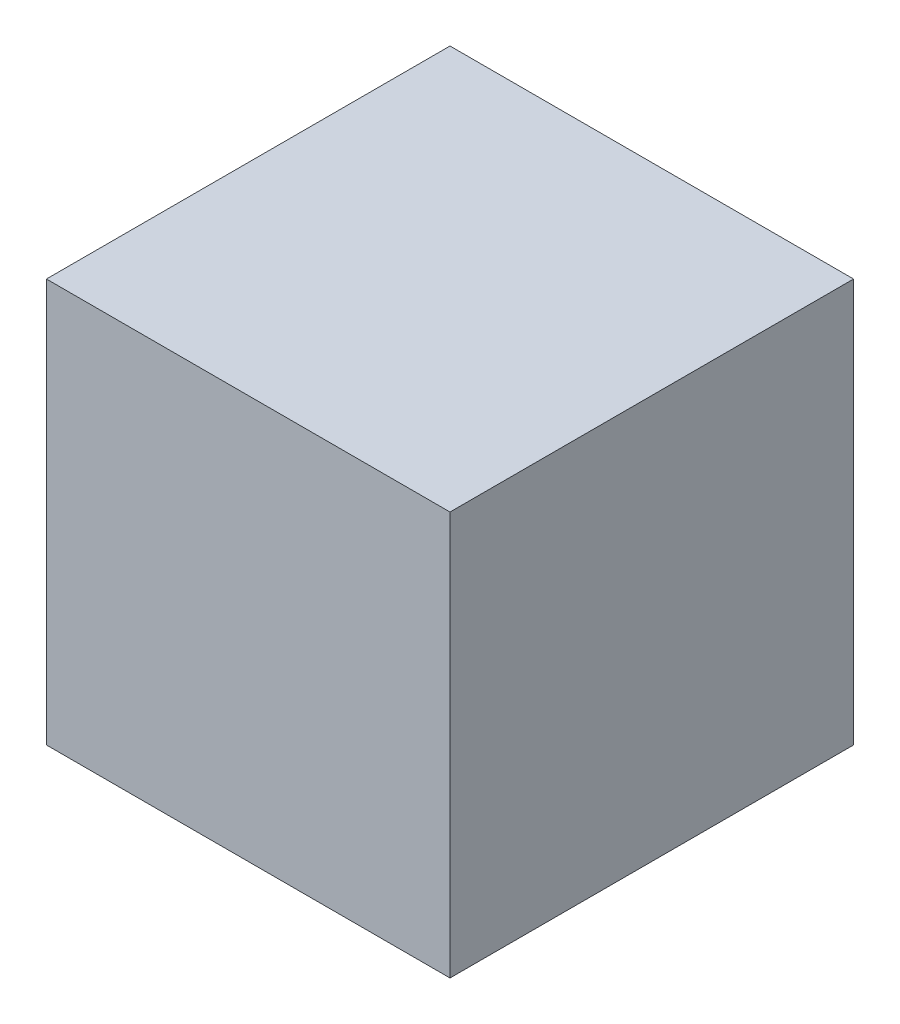
ISO-10303-21;
HEADER;
FILE_DESCRIPTION(('STEP AP214'),'2;1');
FILE_NAME('part.step','',(''),(''),'','','');
FILE_SCHEMA(('AUTOMOTIVE_DESIGN { 1 0 10303 214 1 1 1 1 }'));
ENDSEC;
DATA;
#1=APPLICATION_CONTEXT('core data for automotive mechanical design processes');
#2=APPLICATION_PROTOCOL_DEFINITION('international standard','automotive_design',2000,#1);
#3=PRODUCT_CONTEXT('',#1,'mechanical');
#4=PRODUCT('Part','Part','',(#3));
#5=PRODUCT_RELATED_PRODUCT_CATEGORY('part','',(#4));
#6=PRODUCT_DEFINITION_FORMATION('','',#4);
#7=PRODUCT_DEFINITION_CONTEXT('part definition',#1,'design');
#8=PRODUCT_DEFINITION('design','',#6,#7);
#9=PRODUCT_DEFINITION_SHAPE('','',#8);
#10=(LENGTH_UNIT() NAMED_UNIT(*) SI_UNIT(.MILLI.,.METRE.));
#11=(NAMED_UNIT(*) PLANE_ANGLE_UNIT() SI_UNIT($,.RADIAN.));
#12=(NAMED_UNIT(*) SI_UNIT($,.STERADIAN.) SOLID_ANGLE_UNIT());
#13=UNCERTAINTY_MEASURE_WITH_UNIT(LENGTH_MEASURE(1.E-05),#10,'distance_accuracy_value','');
#14=(GEOMETRIC_REPRESENTATION_CONTEXT(3) GLOBAL_UNCERTAINTY_ASSIGNED_CONTEXT((#13)) GLOBAL_UNIT_ASSIGNED_CONTEXT((#10,
#11,#12)) REPRESENTATION_CONTEXT('',''));
#15=CARTESIAN_POINT('',(0.,0.,0.));
#16=DIRECTION('',(0.,0.,1.));
#17=DIRECTION('',(1.,0.,0.));
#18=AXIS2_PLACEMENT_3D('',#15,#16,#17);
#19=CARTESIAN_POINT('',(311.4675,-311.4675,-311.4675));
#20=DIRECTION('',(0.,0.,1.));
#21=DIRECTION('',(1.,0.,0.));
#22=AXIS2_PLACEMENT_3D('',#19,#20,#21);
#23=PLANE('',#22);
#24=DIRECTION('',(0.,1.,0.));
#25=VECTOR('',#24,1.);
#26=CARTESIAN_POINT('',(-311.4675,-311.4675,-311.4675));
#27=LINE('',#26,#25);
#28=CARTESIAN_POINT('',(-311.4675,-311.4675,-311.4675));
#29=VERTEX_POINT('',#28);
#30=CARTESIAN_POINT('',(-311.4675,311.4675,-311.4675));
#31=VERTEX_POINT('',#30);
#32=EDGE_CURVE('E94',#29,#31,#27,.T.);
#33=ORIENTED_EDGE('',*,*,#32,.T.);
#34=DIRECTION('',(-1.,0.,0.));
#35=VECTOR('',#34,1.);
#36=CARTESIAN_POINT('',(311.4675,311.4675,-311.4675));
#37=LINE('',#36,#35);
#38=CARTESIAN_POINT('',(311.4675,311.4675,-311.4675));
#39=VERTEX_POINT('',#38);
#40=EDGE_CURVE('E11',#39,#31,#37,.T.);
#41=ORIENTED_EDGE('',*,*,#40,.F.);
#42=DIRECTION('',(0.,1.,0.));
#43=VECTOR('',#42,1.);
#44=CARTESIAN_POINT('',(311.4675,-311.4675,-311.4675));
#45=LINE('',#44,#43);
#46=CARTESIAN_POINT('',(311.4675,-311.4675,-311.4675));
#47=VERTEX_POINT('',#46);
#48=EDGE_CURVE('E82',#47,#39,#45,.T.);
#49=ORIENTED_EDGE('',*,*,#48,.F.);
#50=DIRECTION('',(-1.,0.,0.));
#51=VECTOR('',#50,1.);
#52=CARTESIAN_POINT('',(311.4675,-311.4675,-311.4675));
#53=LINE('',#52,#51);
#54=EDGE_CURVE('E90',#47,#29,#53,.T.);
#55=ORIENTED_EDGE('',*,*,#54,.T.);
#56=EDGE_LOOP('',(#33,#41,#49,#55));
#57=FACE_BOUND('',#56,.T.);
#58=ADVANCED_FACE('F31',(#57),#23,.F.);
#59=CARTESIAN_POINT('',(311.4675,311.4675,311.4675));
#60=DIRECTION('',(0.,-1.,0.));
#61=DIRECTION('',(0.,0.,-1.));
#62=AXIS2_PLACEMENT_3D('',#59,#60,#61);
#63=PLANE('',#62);
#64=DIRECTION('',(0.,0.,1.));
#65=VECTOR('',#64,1.);
#66=CARTESIAN_POINT('',(-311.4675,311.4675,311.4675));
#67=LINE('',#66,#65);
#68=CARTESIAN_POINT('',(-311.4675,311.4675,311.4675));
#69=VERTEX_POINT('',#68);
#70=EDGE_CURVE('E86',#31,#69,#67,.T.);
#71=ORIENTED_EDGE('',*,*,#70,.T.);
#72=DIRECTION('',(-1.,0.,0.));
#73=VECTOR('',#72,1.);
#74=CARTESIAN_POINT('',(311.4675,311.4675,311.4675));
#75=LINE('',#74,#73);
#76=CARTESIAN_POINT('',(311.4675,311.4675,311.4675));
#77=VERTEX_POINT('',#76);
#78=EDGE_CURVE('E39',#77,#69,#75,.T.);
#79=ORIENTED_EDGE('',*,*,#78,.F.);
#80=DIRECTION('',(0.,0.,1.));
#81=VECTOR('',#80,1.);
#82=CARTESIAN_POINT('',(311.4675,311.4675,311.4675));
#83=LINE('',#82,#81);
#84=EDGE_CURVE('E77',#39,#77,#83,.T.);
#85=ORIENTED_EDGE('',*,*,#84,.F.);
#86=ORIENTED_EDGE('',*,*,#40,.T.);
#87=EDGE_LOOP('',(#71,#79,#85,#86));
#88=FACE_BOUND('',#87,.T.);
#89=ADVANCED_FACE('F85',(#88),#63,.F.);
#90=CARTESIAN_POINT('',(311.4675,-311.4675,311.4675));
#91=DIRECTION('',(0.,0.,-1.));
#92=DIRECTION('',(-1.,0.,0.));
#93=AXIS2_PLACEMENT_3D('',#90,#91,#92);
#94=PLANE('',#93);
#95=DIRECTION('',(0.,-1.,0.));
#96=VECTOR('',#95,1.);
#97=CARTESIAN_POINT('',(-311.4675,-311.4675,311.4675));
#98=LINE('',#97,#96);
#99=CARTESIAN_POINT('',(-311.4675,-311.4675,311.4675));
#100=VERTEX_POINT('',#99);
#101=EDGE_CURVE('E64',#69,#100,#98,.T.);
#102=ORIENTED_EDGE('',*,*,#101,.T.);
#103=DIRECTION('',(-1.,0.,0.));
#104=VECTOR('',#103,1.);
#105=CARTESIAN_POINT('',(311.4675,-311.4675,311.4675));
#106=LINE('',#105,#104);
#107=CARTESIAN_POINT('',(311.4675,-311.4675,311.4675));
#108=VERTEX_POINT('',#107);
#109=EDGE_CURVE('E87',#108,#100,#106,.T.);
#110=ORIENTED_EDGE('',*,*,#109,.F.);
#111=DIRECTION('',(0.,-1.,0.));
#112=VECTOR('',#111,1.);
#113=CARTESIAN_POINT('',(311.4675,-311.4675,311.4675));
#114=LINE('',#113,#112);
#115=EDGE_CURVE('E80',#77,#108,#114,.T.);
#116=ORIENTED_EDGE('',*,*,#115,.F.);
#117=ORIENTED_EDGE('',*,*,#78,.T.);
#118=EDGE_LOOP('',(#102,#110,#116,#117));
#119=FACE_BOUND('',#118,.T.);
#120=ADVANCED_FACE('F88',(#119),#94,.F.);
#121=CARTESIAN_POINT('',(311.4675,-311.4675,311.4675));
#122=DIRECTION('',(0.,1.,0.));
#123=DIRECTION('',(0.,0.,1.));
#124=AXIS2_PLACEMENT_3D('',#121,#122,#123);
#125=PLANE('',#124);
#126=DIRECTION('',(0.,0.,-1.));
#127=VECTOR('',#126,1.);
#128=CARTESIAN_POINT('',(-311.4675,-311.4675,311.4675));
#129=LINE('',#128,#127);
#130=EDGE_CURVE('E70',#100,#29,#129,.T.);
#131=ORIENTED_EDGE('',*,*,#130,.T.);
#132=ORIENTED_EDGE('',*,*,#54,.F.);
#133=DIRECTION('',(0.,0.,-1.));
#134=VECTOR('',#133,1.);
#135=CARTESIAN_POINT('',(311.4675,-311.4675,311.4675));
#136=LINE('',#135,#134);
#137=EDGE_CURVE('E47',#108,#47,#136,.T.);
#138=ORIENTED_EDGE('',*,*,#137,.F.);
#139=ORIENTED_EDGE('',*,*,#109,.T.);
#140=EDGE_LOOP('',(#131,#132,#138,#139));
#141=FACE_BOUND('',#140,.T.);
#142=ADVANCED_FACE('F101',(#141),#125,.F.);
#143=CARTESIAN_POINT('',(311.4675,311.4675,-311.4675));
#144=DIRECTION('',(-1.,0.,0.));
#145=DIRECTION('',(0.,0.,1.));
#146=AXIS2_PLACEMENT_3D('',#143,#144,#145);
#147=PLANE('',#146);
#148=ORIENTED_EDGE('',*,*,#48,.T.);
#149=ORIENTED_EDGE('',*,*,#84,.T.);
#150=ORIENTED_EDGE('',*,*,#115,.T.);
#151=ORIENTED_EDGE('',*,*,#137,.T.);
#152=EDGE_LOOP('',(#148,#149,#150,#151));
#153=FACE_BOUND('',#152,.T.);
#154=ADVANCED_FACE('F78',(#153),#147,.F.);
#155=CARTESIAN_POINT('',(-311.4675,311.4675,-311.4675));
#156=DIRECTION('',(-1.,0.,0.));
#157=DIRECTION('',(0.,0.,1.));
#158=AXIS2_PLACEMENT_3D('',#155,#156,#157);
#159=PLANE('',#158);
#160=ORIENTED_EDGE('',*,*,#32,.F.);
#161=ORIENTED_EDGE('',*,*,#130,.F.);
#162=ORIENTED_EDGE('',*,*,#101,.F.);
#163=ORIENTED_EDGE('',*,*,#70,.F.);
#164=EDGE_LOOP('',(#160,#161,#162,#163));
#165=FACE_BOUND('',#164,.T.);
#166=ADVANCED_FACE('F104',(#165),#159,.T.);
#167=CLOSED_SHELL('',(#58,#89,#120,#142,#154,#166));
#168=MANIFOLD_SOLID_BREP('B2',#167);
#169=ADVANCED_BREP_SHAPE_REPRESENTATION('',(#18,#168),#14);
#170=SHAPE_DEFINITION_REPRESENTATION(#9,#169);
ENDSEC;
END-ISO-10303-21;
